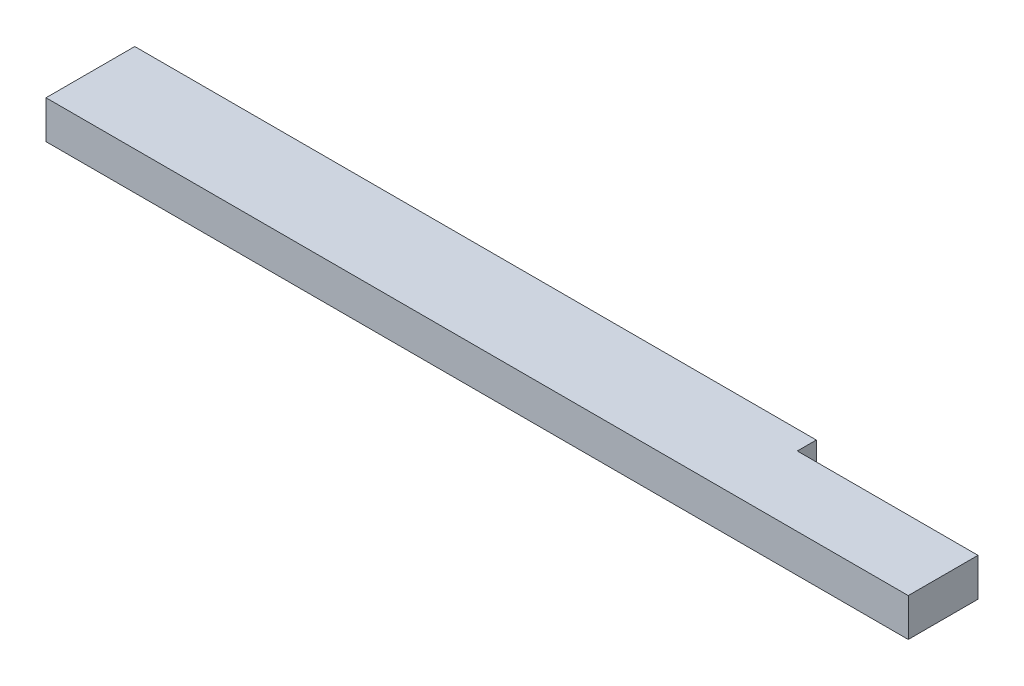
ISO-10303-21;
HEADER;
FILE_DESCRIPTION(('STEP AP214'),'2;1');
FILE_NAME('part.step','',(''),(''),'','','');
FILE_SCHEMA(('AUTOMOTIVE_DESIGN { 1 0 10303 214 1 1 1 1 }'));
ENDSEC;
DATA;
#1=APPLICATION_CONTEXT('core data for automotive mechanical design processes');
#2=APPLICATION_PROTOCOL_DEFINITION('international standard','automotive_design',2000,#1);
#3=PRODUCT_CONTEXT('',#1,'mechanical');
#4=PRODUCT('Part','Part','',(#3));
#5=PRODUCT_RELATED_PRODUCT_CATEGORY('part','',(#4));
#6=PRODUCT_DEFINITION_FORMATION('','',#4);
#7=PRODUCT_DEFINITION_CONTEXT('part definition',#1,'design');
#8=PRODUCT_DEFINITION('design','',#6,#7);
#9=PRODUCT_DEFINITION_SHAPE('','',#8);
#10=(LENGTH_UNIT() NAMED_UNIT(*) SI_UNIT(.MILLI.,.METRE.));
#11=(NAMED_UNIT(*) PLANE_ANGLE_UNIT() SI_UNIT($,.RADIAN.));
#12=(NAMED_UNIT(*) SI_UNIT($,.STERADIAN.) SOLID_ANGLE_UNIT());
#13=UNCERTAINTY_MEASURE_WITH_UNIT(LENGTH_MEASURE(1.E-05),#10,'distance_accuracy_value','');
#14=(GEOMETRIC_REPRESENTATION_CONTEXT(3) GLOBAL_UNCERTAINTY_ASSIGNED_CONTEXT((#13)) GLOBAL_UNIT_ASSIGNED_CONTEXT((#10,
#11,#12)) REPRESENTATION_CONTEXT('',''));
#15=CARTESIAN_POINT('',(0.,0.,0.));
#16=DIRECTION('',(0.,0.,1.));
#17=DIRECTION('',(1.,0.,0.));
#18=AXIS2_PLACEMENT_3D('',#15,#16,#17);
#19=CARTESIAN_POINT('',(0.,38.1,0.));
#20=DIRECTION('',(1.,0.,0.));
#21=DIRECTION('',(0.,0.,-1.));
#22=AXIS2_PLACEMENT_3D('',#19,#20,#21);
#23=PLANE('',#22);
#24=DIRECTION('',(0.,0.,1.));
#25=VECTOR('',#24,1.);
#26=CARTESIAN_POINT('',(0.,0.,0.));
#27=LINE('',#26,#25);
#28=CARTESIAN_POINT('',(0.,0.,-88.9));
#29=VERTEX_POINT('',#28);
#30=CARTESIAN_POINT('',(0.,0.,0.));
#31=VERTEX_POINT('',#30);
#32=EDGE_CURVE('E112',#29,#31,#27,.T.);
#33=ORIENTED_EDGE('',*,*,#32,.T.);
#34=DIRECTION('',(0.,-1.,0.));
#35=VECTOR('',#34,1.);
#36=CARTESIAN_POINT('',(0.,38.1,0.));
#37=LINE('',#36,#35);
#38=CARTESIAN_POINT('',(0.,38.1,0.));
#39=VERTEX_POINT('',#38);
#40=EDGE_CURVE('E11',#39,#31,#37,.T.);
#41=ORIENTED_EDGE('',*,*,#40,.F.);
#42=DIRECTION('',(0.,0.,1.));
#43=VECTOR('',#42,1.);
#44=CARTESIAN_POINT('',(0.,38.1,0.));
#45=LINE('',#44,#43);
#46=CARTESIAN_POINT('',(0.,38.1,-88.9));
#47=VERTEX_POINT('',#46);
#48=EDGE_CURVE('E113',#47,#39,#45,.T.);
#49=ORIENTED_EDGE('',*,*,#48,.F.);
#50=DIRECTION('',(0.,-1.,0.));
#51=VECTOR('',#50,1.);
#52=CARTESIAN_POINT('',(0.,38.1,-88.9));
#53=LINE('',#52,#51);
#54=EDGE_CURVE('E122',#47,#29,#53,.T.);
#55=ORIENTED_EDGE('',*,*,#54,.T.);
#56=EDGE_LOOP('',(#33,#41,#49,#55));
#57=FACE_BOUND('',#56,.T.);
#58=ADVANCED_FACE('F38',(#57),#23,.F.);
#59=CARTESIAN_POINT('',(0.,38.1,0.));
#60=DIRECTION('',(0.,0.,-1.));
#61=DIRECTION('',(-1.,0.,0.));
#62=AXIS2_PLACEMENT_3D('',#59,#60,#61);
#63=PLANE('',#62);
#64=DIRECTION('',(1.,0.,0.));
#65=VECTOR('',#64,1.);
#66=CARTESIAN_POINT('',(0.,0.,0.));
#67=LINE('',#66,#65);
#68=CARTESIAN_POINT('',(863.6,0.,0.));
#69=VERTEX_POINT('',#68);
#70=EDGE_CURVE('E118',#31,#69,#67,.T.);
#71=ORIENTED_EDGE('',*,*,#70,.T.);
#72=DIRECTION('',(0.,-1.,0.));
#73=VECTOR('',#72,1.);
#74=CARTESIAN_POINT('',(863.6,38.1,0.));
#75=LINE('',#74,#73);
#76=CARTESIAN_POINT('',(863.6,38.1,0.));
#77=VERTEX_POINT('',#76);
#78=EDGE_CURVE('E45',#77,#69,#75,.T.);
#79=ORIENTED_EDGE('',*,*,#78,.F.);
#80=DIRECTION('',(1.,0.,0.));
#81=VECTOR('',#80,1.);
#82=CARTESIAN_POINT('',(0.,38.1,0.));
#83=LINE('',#82,#81);
#84=EDGE_CURVE('E84',#39,#77,#83,.T.);
#85=ORIENTED_EDGE('',*,*,#84,.F.);
#86=ORIENTED_EDGE('',*,*,#40,.T.);
#87=EDGE_LOOP('',(#71,#79,#85,#86));
#88=FACE_BOUND('',#87,.T.);
#89=ADVANCED_FACE('F142',(#88),#63,.F.);
#90=CARTESIAN_POINT('',(863.6,38.1,0.));
#91=DIRECTION('',(-1.,0.,0.));
#92=DIRECTION('',(0.,0.,1.));
#93=AXIS2_PLACEMENT_3D('',#90,#91,#92);
#94=PLANE('',#93);
#95=DIRECTION('',(0.,0.,-1.));
#96=VECTOR('',#95,1.);
#97=CARTESIAN_POINT('',(863.6,0.,0.));
#98=LINE('',#97,#96);
#99=CARTESIAN_POINT('',(863.6,0.,-69.85));
#100=VERTEX_POINT('',#99);
#101=EDGE_CURVE('E114',#69,#100,#98,.T.);
#102=ORIENTED_EDGE('',*,*,#101,.T.);
#103=DIRECTION('',(0.,1.,0.));
#104=VECTOR('',#103,1.);
#105=CARTESIAN_POINT('',(863.6,0.,-69.85));
#106=LINE('',#105,#104);
#107=CARTESIAN_POINT('',(863.6,38.1,-69.85));
#108=VERTEX_POINT('',#107);
#109=EDGE_CURVE('E136',#100,#108,#106,.T.);
#110=ORIENTED_EDGE('',*,*,#109,.T.);
#111=DIRECTION('',(0.,0.,-1.));
#112=VECTOR('',#111,1.);
#113=CARTESIAN_POINT('',(863.6,38.1,0.));
#114=LINE('',#113,#112);
#115=EDGE_CURVE('E130',#77,#108,#114,.T.);
#116=ORIENTED_EDGE('',*,*,#115,.F.);
#117=ORIENTED_EDGE('',*,*,#78,.T.);
#118=EDGE_LOOP('',(#102,#110,#116,#117));
#119=FACE_BOUND('',#118,.T.);
#120=ADVANCED_FACE('F127',(#119),#94,.F.);
#121=CARTESIAN_POINT('',(0.,38.1,-88.9));
#122=DIRECTION('',(0.,0.,1.));
#123=DIRECTION('',(1.,0.,0.));
#124=AXIS2_PLACEMENT_3D('',#121,#122,#123);
#125=PLANE('',#124);
#126=DIRECTION('',(-1.,0.,0.));
#127=VECTOR('',#126,1.);
#128=CARTESIAN_POINT('',(0.,38.1,-88.9));
#129=LINE('',#128,#127);
#130=CARTESIAN_POINT('',(682.625,38.1,-88.9));
#131=VERTEX_POINT('',#130);
#132=EDGE_CURVE('E61',#131,#47,#129,.T.);
#133=ORIENTED_EDGE('',*,*,#132,.F.);
#134=DIRECTION('',(0.,1.,0.));
#135=VECTOR('',#134,1.);
#136=CARTESIAN_POINT('',(682.625,0.,-88.9));
#137=LINE('',#136,#135);
#138=CARTESIAN_POINT('',(682.625,0.,-88.9));
#139=VERTEX_POINT('',#138);
#140=EDGE_CURVE('E102',#139,#131,#137,.T.);
#141=ORIENTED_EDGE('',*,*,#140,.F.);
#142=DIRECTION('',(-1.,0.,0.));
#143=VECTOR('',#142,1.);
#144=CARTESIAN_POINT('',(0.,0.,-88.9));
#145=LINE('',#144,#143);
#146=EDGE_CURVE('E79',#139,#29,#145,.T.);
#147=ORIENTED_EDGE('',*,*,#146,.T.);
#148=ORIENTED_EDGE('',*,*,#54,.F.);
#149=EDGE_LOOP('',(#133,#141,#147,#148));
#150=FACE_BOUND('',#149,.T.);
#151=ADVANCED_FACE('F107',(#150),#125,.F.);
#152=CARTESIAN_POINT('',(0.,38.1,0.));
#153=DIRECTION('',(0.,-1.,0.));
#154=DIRECTION('',(0.,0.,-1.));
#155=AXIS2_PLACEMENT_3D('',#152,#153,#154);
#156=PLANE('',#155);
#157=ORIENTED_EDGE('',*,*,#115,.T.);
#158=DIRECTION('',(1.,0.,0.));
#159=VECTOR('',#158,1.);
#160=CARTESIAN_POINT('',(863.6,38.1,-69.85));
#161=LINE('',#160,#159);
#162=CARTESIAN_POINT('',(682.625,38.1,-69.85));
#163=VERTEX_POINT('',#162);
#164=EDGE_CURVE('E105',#163,#108,#161,.T.);
#165=ORIENTED_EDGE('',*,*,#164,.F.);
#166=DIRECTION('',(0.,0.,1.));
#167=VECTOR('',#166,1.);
#168=CARTESIAN_POINT('',(682.625,38.1,-88.9));
#169=LINE('',#168,#167);
#170=EDGE_CURVE('E133',#131,#163,#169,.T.);
#171=ORIENTED_EDGE('',*,*,#170,.F.);
#172=ORIENTED_EDGE('',*,*,#132,.T.);
#173=ORIENTED_EDGE('',*,*,#48,.T.);
#174=ORIENTED_EDGE('',*,*,#84,.T.);
#175=EDGE_LOOP('',(#157,#165,#171,#172,#173,#174));
#176=FACE_BOUND('',#175,.T.);
#177=ADVANCED_FACE('F146',(#176),#156,.F.);
#178=CARTESIAN_POINT('',(0.,0.,0.));
#179=DIRECTION('',(0.,-1.,0.));
#180=DIRECTION('',(0.,0.,-1.));
#181=AXIS2_PLACEMENT_3D('',#178,#179,#180);
#182=PLANE('',#181);
#183=DIRECTION('',(1.,0.,0.));
#184=VECTOR('',#183,1.);
#185=CARTESIAN_POINT('',(863.6,0.,-69.85));
#186=LINE('',#185,#184);
#187=CARTESIAN_POINT('',(682.625,0.,-69.85));
#188=VERTEX_POINT('',#187);
#189=EDGE_CURVE('E52',#188,#100,#186,.T.);
#190=ORIENTED_EDGE('',*,*,#189,.T.);
#191=ORIENTED_EDGE('',*,*,#101,.F.);
#192=ORIENTED_EDGE('',*,*,#70,.F.);
#193=ORIENTED_EDGE('',*,*,#32,.F.);
#194=ORIENTED_EDGE('',*,*,#146,.F.);
#195=DIRECTION('',(0.,0.,1.));
#196=VECTOR('',#195,1.);
#197=CARTESIAN_POINT('',(682.625,0.,-88.9));
#198=LINE('',#197,#196);
#199=EDGE_CURVE('E99',#139,#188,#198,.T.);
#200=ORIENTED_EDGE('',*,*,#199,.T.);
#201=EDGE_LOOP('',(#190,#191,#192,#193,#194,#200));
#202=FACE_BOUND('',#201,.T.);
#203=ADVANCED_FACE('F110',(#202),#182,.T.);
#204=CARTESIAN_POINT('',(863.6,0.,-69.85));
#205=DIRECTION('',(0.,0.,1.));
#206=DIRECTION('',(1.,0.,0.));
#207=AXIS2_PLACEMENT_3D('',#204,#205,#206);
#208=PLANE('',#207);
#209=ORIENTED_EDGE('',*,*,#164,.T.);
#210=ORIENTED_EDGE('',*,*,#109,.F.);
#211=ORIENTED_EDGE('',*,*,#189,.F.);
#212=DIRECTION('',(0.,1.,0.));
#213=VECTOR('',#212,1.);
#214=CARTESIAN_POINT('',(682.625,0.,-69.85));
#215=LINE('',#214,#213);
#216=EDGE_CURVE('E103',#188,#163,#215,.T.);
#217=ORIENTED_EDGE('',*,*,#216,.T.);
#218=EDGE_LOOP('',(#209,#210,#211,#217));
#219=FACE_BOUND('',#218,.T.);
#220=ADVANCED_FACE('F148',(#219),#208,.F.);
#221=CARTESIAN_POINT('',(682.625,0.,-88.9));
#222=DIRECTION('',(-1.,0.,0.));
#223=DIRECTION('',(0.,0.,1.));
#224=AXIS2_PLACEMENT_3D('',#221,#222,#223);
#225=PLANE('',#224);
#226=ORIENTED_EDGE('',*,*,#170,.T.);
#227=ORIENTED_EDGE('',*,*,#216,.F.);
#228=ORIENTED_EDGE('',*,*,#199,.F.);
#229=ORIENTED_EDGE('',*,*,#140,.T.);
#230=EDGE_LOOP('',(#226,#227,#228,#229));
#231=FACE_BOUND('',#230,.T.);
#232=ADVANCED_FACE('F101',(#231),#225,.F.);
#233=CLOSED_SHELL('',(#58,#89,#120,#151,#177,#203,#220,#232));
#234=MANIFOLD_SOLID_BREP('B2',#233);
#235=ADVANCED_BREP_SHAPE_REPRESENTATION('',(#18,#234),#14);
#236=SHAPE_DEFINITION_REPRESENTATION(#9,#235);
ENDSEC;
END-ISO-10303-21;
